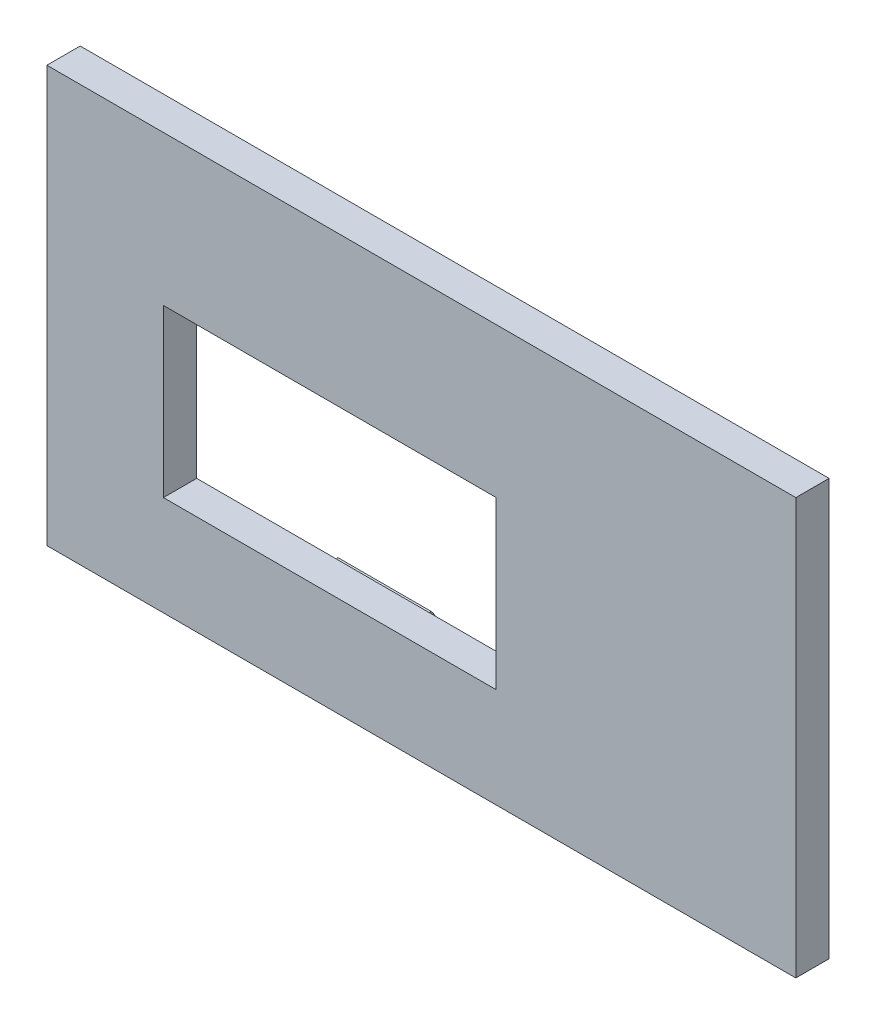
ISO-10303-21;
HEADER;
FILE_DESCRIPTION(('STEP AP214'),'2;1');
FILE_NAME('part.step','',(''),(''),'','','');
FILE_SCHEMA(('AUTOMOTIVE_DESIGN { 1 0 10303 214 1 1 1 1 }'));
ENDSEC;
DATA;
#1=APPLICATION_CONTEXT('core data for automotive mechanical design processes');
#2=APPLICATION_PROTOCOL_DEFINITION('international standard','automotive_design',2000,#1);
#3=PRODUCT_CONTEXT('',#1,'mechanical');
#4=PRODUCT('Part','Part','',(#3));
#5=PRODUCT_RELATED_PRODUCT_CATEGORY('part','',(#4));
#6=PRODUCT_DEFINITION_FORMATION('','',#4);
#7=PRODUCT_DEFINITION_CONTEXT('part definition',#1,'design');
#8=PRODUCT_DEFINITION('design','',#6,#7);
#9=PRODUCT_DEFINITION_SHAPE('','',#8);
#10=(LENGTH_UNIT() NAMED_UNIT(*) SI_UNIT(.MILLI.,.METRE.));
#11=(NAMED_UNIT(*) PLANE_ANGLE_UNIT() SI_UNIT($,.RADIAN.));
#12=(NAMED_UNIT(*) SI_UNIT($,.STERADIAN.) SOLID_ANGLE_UNIT());
#13=UNCERTAINTY_MEASURE_WITH_UNIT(LENGTH_MEASURE(1.E-05),#10,'distance_accuracy_value','');
#14=(GEOMETRIC_REPRESENTATION_CONTEXT(3) GLOBAL_UNCERTAINTY_ASSIGNED_CONTEXT((#13)) GLOBAL_UNIT_ASSIGNED_CONTEXT((#10,
#11,#12)) REPRESENTATION_CONTEXT('',''));
#15=CARTESIAN_POINT('',(0.,0.,0.));
#16=DIRECTION('',(0.,0.,1.));
#17=DIRECTION('',(1.,0.,0.));
#18=AXIS2_PLACEMENT_3D('',#15,#16,#17);
#19=CARTESIAN_POINT('',(20.6088165403814,-7.5,8.));
#20=DIRECTION('',(1.,0.,0.));
#21=DIRECTION('',(0.,0.,-1.));
#22=AXIS2_PLACEMENT_3D('',#19,#20,#21);
#23=CYLINDRICAL_SURFACE('',#22,1.);
#24=DIRECTION('',(1.,0.,0.));
#25=VECTOR('',#24,1.);
#26=CARTESIAN_POINT('',(-2.5,-8.5,8.));
#27=LINE('',#26,#25);
#28=CARTESIAN_POINT('',(-2.5,-8.5,8.));
#29=VERTEX_POINT('',#28);
#30=CARTESIAN_POINT('',(2.5,-8.5,8.));
#31=VERTEX_POINT('',#30);
#32=EDGE_CURVE('E782',#29,#31,#27,.T.);
#33=ORIENTED_EDGE('',*,*,#32,.F.);
#34=CARTESIAN_POINT('',(-2.5,-7.5,8.));
#35=DIRECTION('',(1.,0.,0.));
#36=DIRECTION('',(0.,0.,-1.));
#37=AXIS2_PLACEMENT_3D('',#34,#35,#36);
#38=CIRCLE('',#37,1.);
#39=CARTESIAN_POINT('',(-2.5,-6.79289321881346,7.29289321881345));
#40=VERTEX_POINT('',#39);
#41=EDGE_CURVE('E228',#29,#40,#38,.T.);
#42=ORIENTED_EDGE('',*,*,#41,.T.);
#43=DIRECTION('',(-1.,0.,0.));
#44=VECTOR('',#43,1.);
#45=CARTESIAN_POINT('',(23.5764722676078,-6.79289321881346,7.29289321881345));
#46=LINE('',#45,#44);
#47=CARTESIAN_POINT('',(-8.09013566471156,-6.79289321881346,7.29289321881345));
#48=VERTEX_POINT('',#47);
#49=EDGE_CURVE('E227',#40,#48,#46,.T.);
#50=ORIENTED_EDGE('',*,*,#49,.T.);
#51=CARTESIAN_POINT('',(-8.09013566471156,-7.5,8.));
#52=DIRECTION('',(1.,0.,0.));
#53=DIRECTION('',(0.,0.,-1.));
#54=AXIS2_PLACEMENT_3D('',#51,#52,#53);
#55=CIRCLE('',#54,1.);
#56=CARTESIAN_POINT('',(-8.09013566471156,-8.5,8.));
#57=VERTEX_POINT('',#56);
#58=EDGE_CURVE('E791',#57,#48,#55,.T.);
#59=ORIENTED_EDGE('',*,*,#58,.F.);
#60=CARTESIAN_POINT('',(-8.09013566471156,-7.5,8.));
#61=DIRECTION('',(-1.,0.,0.));
#62=DIRECTION('',(0.,0.,-1.));
#63=AXIS2_PLACEMENT_3D('',#60,#61,#62);
#64=CIRCLE('',#63,1.);
#65=CARTESIAN_POINT('',(-8.09013566471156,-6.5,8.));
#66=VERTEX_POINT('',#65);
#67=EDGE_CURVE('E58',#57,#66,#64,.T.);
#68=ORIENTED_EDGE('',*,*,#67,.T.);
#69=DIRECTION('',(1.,0.,0.));
#70=VECTOR('',#69,1.);
#71=CARTESIAN_POINT('',(20.6088165403814,-6.5,8.));
#72=LINE('',#71,#70);
#73=CARTESIAN_POINT('',(20.6088165403814,-6.5,8.));
#74=VERTEX_POINT('',#73);
#75=EDGE_CURVE('E391',#66,#74,#72,.T.);
#76=ORIENTED_EDGE('',*,*,#75,.T.);
#77=CARTESIAN_POINT('',(20.6088165403814,-7.5,8.));
#78=DIRECTION('',(-1.,0.,0.));
#79=DIRECTION('',(0.,0.,-1.));
#80=AXIS2_PLACEMENT_3D('',#77,#78,#79);
#81=CIRCLE('',#80,1.);
#82=CARTESIAN_POINT('',(20.6088165403814,-8.5,8.));
#83=VERTEX_POINT('',#82);
#84=EDGE_CURVE('E250',#83,#74,#81,.T.);
#85=ORIENTED_EDGE('',*,*,#84,.F.);
#86=CARTESIAN_POINT('',(20.6088165403814,-7.5,8.));
#87=DIRECTION('',(1.,0.,0.));
#88=DIRECTION('',(0.,0.,-1.));
#89=AXIS2_PLACEMENT_3D('',#86,#87,#88);
#90=CIRCLE('',#89,1.);
#91=CARTESIAN_POINT('',(20.6088165403814,-6.79289321881346,7.29289321881345));
#92=VERTEX_POINT('',#91);
#93=EDGE_CURVE('E244',#83,#92,#90,.T.);
#94=ORIENTED_EDGE('',*,*,#93,.T.);
#95=CARTESIAN_POINT('',(2.5,-6.79289321881346,7.29289321881345));
#96=VERTEX_POINT('',#95);
#97=EDGE_CURVE('E240',#92,#96,#46,.T.);
#98=ORIENTED_EDGE('',*,*,#97,.T.);
#99=CARTESIAN_POINT('',(2.5,-7.5,8.));
#100=DIRECTION('',(1.,0.,0.));
#101=DIRECTION('',(0.,0.,-1.));
#102=AXIS2_PLACEMENT_3D('',#99,#100,#101);
#103=CIRCLE('',#102,1.);
#104=EDGE_CURVE('E784',#31,#96,#103,.T.);
#105=ORIENTED_EDGE('',*,*,#104,.F.);
#106=EDGE_LOOP('',(#33,#42,#50,#59,#68,#76,#85,#94,#98,#105));
#107=FACE_BOUND('',#106,.T.);
#108=ADVANCED_FACE('F35',(#107),#23,.F.);
#109=CARTESIAN_POINT('',(23.5764722676078,-6.79289321881346,7.29289321881345));
#110=DIRECTION('',(0.,0.707106781186548,0.707106781186547));
#111=DIRECTION('',(0.,-0.707106781186547,0.707106781186548));
#112=AXIS2_PLACEMENT_3D('',#109,#110,#111);
#113=PLANE('',#112);
#114=ORIENTED_EDGE('',*,*,#49,.F.);
#115=DIRECTION('',(0.,0.707106781186548,-0.707106781186547));
#116=VECTOR('',#115,1.);
#117=CARTESIAN_POINT('',(-2.5,-6.79289321881346,7.29289321881345));
#118=LINE('',#117,#116);
#119=CARTESIAN_POINT('',(-2.5,-6.43933982822018,6.93933982822018));
#120=VERTEX_POINT('',#119);
#121=EDGE_CURVE('E213',#40,#120,#118,.T.);
#122=ORIENTED_EDGE('',*,*,#121,.T.);
#123=DIRECTION('',(-1.,0.,0.));
#124=VECTOR('',#123,1.);
#125=CARTESIAN_POINT('',(23.5764722676078,-6.43933982822018,6.93933982822018));
#126=LINE('',#125,#124);
#127=CARTESIAN_POINT('',(-8.09013566471156,-6.43933982822018,6.93933982822018));
#128=VERTEX_POINT('',#127);
#129=EDGE_CURVE('E225',#120,#128,#126,.T.);
#130=ORIENTED_EDGE('',*,*,#129,.T.);
#131=DIRECTION('',(0.,0.707106781186547,-0.707106781186548));
#132=VECTOR('',#131,1.);
#133=CARTESIAN_POINT('',(-8.09013566471156,-6.79289321881346,7.29289321881345));
#134=LINE('',#133,#132);
#135=EDGE_CURVE('E794',#48,#128,#134,.T.);
#136=ORIENTED_EDGE('',*,*,#135,.F.);
#137=EDGE_LOOP('',(#114,#122,#130,#136));
#138=FACE_BOUND('',#137,.T.);
#139=ADVANCED_FACE('F223',(#138),#113,.T.);
#140=CARTESIAN_POINT('',(23.5764722676078,-7.5,8.));
#141=DIRECTION('',(-1.,0.,0.));
#142=DIRECTION('',(0.,0.,1.));
#143=AXIS2_PLACEMENT_3D('',#140,#141,#142);
#144=CYLINDRICAL_SURFACE('',#143,1.5);
#145=ORIENTED_EDGE('',*,*,#129,.F.);
#146=CARTESIAN_POINT('',(-2.5,-7.5,8.));
#147=DIRECTION('',(-1.,0.,0.));
#148=DIRECTION('',(0.,0.,-1.));
#149=AXIS2_PLACEMENT_3D('',#146,#147,#148);
#150=CIRCLE('',#149,1.5);
#151=CARTESIAN_POINT('',(-2.5,-9.00000000000001,8.));
#152=VERTEX_POINT('',#151);
#153=EDGE_CURVE('E209',#120,#152,#150,.T.);
#154=ORIENTED_EDGE('',*,*,#153,.T.);
#155=DIRECTION('',(-1.,0.,0.));
#156=VECTOR('',#155,1.);
#157=CARTESIAN_POINT('',(23.5764722676078,-9.00000000000001,8.));
#158=LINE('',#157,#156);
#159=CARTESIAN_POINT('',(-8.09013566471156,-9.00000000000001,8.));
#160=VERTEX_POINT('',#159);
#161=EDGE_CURVE('E251',#152,#160,#158,.T.);
#162=ORIENTED_EDGE('',*,*,#161,.T.);
#163=CARTESIAN_POINT('',(-8.09013566471156,-7.5,8.));
#164=DIRECTION('',(-1.,0.,0.));
#165=DIRECTION('',(0.,0.,-1.));
#166=AXIS2_PLACEMENT_3D('',#163,#164,#165);
#167=CIRCLE('',#166,1.5);
#168=EDGE_CURVE('E232',#128,#160,#167,.T.);
#169=ORIENTED_EDGE('',*,*,#168,.F.);
#170=EDGE_LOOP('',(#145,#154,#162,#169));
#171=FACE_BOUND('',#170,.T.);
#172=ADVANCED_FACE('F230',(#171),#144,.T.);
#173=CARTESIAN_POINT('',(0.,0.,8.));
#174=DIRECTION('',(0.,0.,1.));
#175=DIRECTION('',(1.,0.,0.));
#176=AXIS2_PLACEMENT_3D('',#173,#174,#175);
#177=PLANE('',#176);
#178=CARTESIAN_POINT('',(20.6088165403814,-9.00000000000001,8.));
#179=VERTEX_POINT('',#178);
#180=CARTESIAN_POINT('',(2.5,-9.00000000000001,8.));
#181=VERTEX_POINT('',#180);
#182=EDGE_CURVE('E247',#179,#181,#158,.T.);
#183=ORIENTED_EDGE('',*,*,#182,.F.);
#184=DIRECTION('',(0.,1.,0.));
#185=VECTOR('',#184,1.);
#186=CARTESIAN_POINT('',(20.6088165403814,-9.00000000000001,8.));
#187=LINE('',#186,#185);
#188=EDGE_CURVE('E780',#179,#83,#187,.T.);
#189=ORIENTED_EDGE('',*,*,#188,.T.);
#190=DIRECTION('',(0.,1.,0.));
#191=VECTOR('',#190,1.);
#192=CARTESIAN_POINT('',(20.6088165403814,0.,8.));
#193=LINE('',#192,#191);
#194=EDGE_CURVE('E11',#83,#74,#193,.T.);
#195=ORIENTED_EDGE('',*,*,#194,.T.);
#196=ORIENTED_EDGE('',*,*,#75,.F.);
#197=DIRECTION('',(0.,-1.,0.));
#198=VECTOR('',#197,1.);
#199=CARTESIAN_POINT('',(-8.09013566471156,0.,8.));
#200=LINE('',#199,#198);
#201=EDGE_CURVE('E43',#66,#57,#200,.T.);
#202=ORIENTED_EDGE('',*,*,#201,.T.);
#203=DIRECTION('',(0.,1.,0.));
#204=VECTOR('',#203,1.);
#205=CARTESIAN_POINT('',(-8.09013566471156,-9.00000000000001,8.));
#206=LINE('',#205,#204);
#207=EDGE_CURVE('E399',#160,#57,#206,.T.);
#208=ORIENTED_EDGE('',*,*,#207,.F.);
#209=ORIENTED_EDGE('',*,*,#161,.F.);
#210=DIRECTION('',(0.,1.,0.));
#211=VECTOR('',#210,1.);
#212=CARTESIAN_POINT('',(-2.5,-9.00000000000001,8.));
#213=LINE('',#212,#211);
#214=EDGE_CURVE('E215',#152,#29,#213,.T.);
#215=ORIENTED_EDGE('',*,*,#214,.T.);
#216=ORIENTED_EDGE('',*,*,#32,.T.);
#217=DIRECTION('',(0.,1.,0.));
#218=VECTOR('',#217,1.);
#219=CARTESIAN_POINT('',(2.5,-9.00000000000001,8.));
#220=LINE('',#219,#218);
#221=EDGE_CURVE('E219',#181,#31,#220,.T.);
#222=ORIENTED_EDGE('',*,*,#221,.F.);
#223=EDGE_LOOP('',(#183,#189,#195,#196,#202,#208,#209,#215,#216,#222));
#224=FACE_BOUND('',#223,.T.);
#225=DIRECTION('',(0.,-1.,0.));
#226=VECTOR('',#225,1.);
#227=CARTESIAN_POINT('',(-8.09013566471156,9.00000000000001,8.));
#228=LINE('',#227,#226);
#229=CARTESIAN_POINT('',(-8.09013566471156,9.00000000000001,8.));
#230=VERTEX_POINT('',#229);
#231=CARTESIAN_POINT('',(-8.09013566471156,8.5,8.));
#232=VERTEX_POINT('',#231);
#233=EDGE_CURVE('E290',#230,#232,#228,.T.);
#234=ORIENTED_EDGE('',*,*,#233,.T.);
#235=DIRECTION('',(0.,-1.,0.));
#236=VECTOR('',#235,1.);
#237=CARTESIAN_POINT('',(-8.09013566471156,0.,8.));
#238=LINE('',#237,#236);
#239=CARTESIAN_POINT('',(-8.09013566471156,6.5,8.));
#240=VERTEX_POINT('',#239);
#241=EDGE_CURVE('E383',#232,#240,#238,.T.);
#242=ORIENTED_EDGE('',*,*,#241,.T.);
#243=DIRECTION('',(1.,0.,0.));
#244=VECTOR('',#243,1.);
#245=CARTESIAN_POINT('',(20.6088165403814,6.5,8.));
#246=LINE('',#245,#244);
#247=CARTESIAN_POINT('',(20.6088165403814,6.5,8.));
#248=VERTEX_POINT('',#247);
#249=EDGE_CURVE('E389',#248,#240,#246,.F.);
#250=ORIENTED_EDGE('',*,*,#249,.F.);
#251=DIRECTION('',(0.,1.,0.));
#252=VECTOR('',#251,1.);
#253=CARTESIAN_POINT('',(20.6088165403814,0.,8.));
#254=LINE('',#253,#252);
#255=CARTESIAN_POINT('',(20.6088165403814,8.5,8.));
#256=VERTEX_POINT('',#255);
#257=EDGE_CURVE('E386',#248,#256,#254,.T.);
#258=ORIENTED_EDGE('',*,*,#257,.T.);
#259=DIRECTION('',(0.,-1.,0.));
#260=VECTOR('',#259,1.);
#261=CARTESIAN_POINT('',(20.6088165403814,9.00000000000001,8.));
#262=LINE('',#261,#260);
#263=CARTESIAN_POINT('',(20.6088165403814,9.00000000000001,8.));
#264=VERTEX_POINT('',#263);
#265=EDGE_CURVE('E303',#264,#256,#262,.T.);
#266=ORIENTED_EDGE('',*,*,#265,.F.);
#267=DIRECTION('',(-1.,0.,0.));
#268=VECTOR('',#267,1.);
#269=CARTESIAN_POINT('',(23.5764722676078,9.00000000000001,8.));
#270=LINE('',#269,#268);
#271=CARTESIAN_POINT('',(2.5,9.00000000000001,8.));
#272=VERTEX_POINT('',#271);
#273=EDGE_CURVE('E293',#264,#272,#270,.T.);
#274=ORIENTED_EDGE('',*,*,#273,.T.);
#275=DIRECTION('',(0.,-1.,0.));
#276=VECTOR('',#275,1.);
#277=CARTESIAN_POINT('',(2.5,9.00000000000001,8.));
#278=LINE('',#277,#276);
#279=CARTESIAN_POINT('',(2.5,8.5,8.));
#280=VERTEX_POINT('',#279);
#281=EDGE_CURVE('E270',#272,#280,#278,.T.);
#282=ORIENTED_EDGE('',*,*,#281,.T.);
#283=DIRECTION('',(1.,0.,0.));
#284=VECTOR('',#283,1.);
#285=CARTESIAN_POINT('',(-2.5,8.5,8.));
#286=LINE('',#285,#284);
#287=CARTESIAN_POINT('',(-2.5,8.5,8.));
#288=VERTEX_POINT('',#287);
#289=EDGE_CURVE('E267',#288,#280,#286,.T.);
#290=ORIENTED_EDGE('',*,*,#289,.F.);
#291=DIRECTION('',(0.,-1.,0.));
#292=VECTOR('',#291,1.);
#293=CARTESIAN_POINT('',(-2.5,9.00000000000001,8.));
#294=LINE('',#293,#292);
#295=CARTESIAN_POINT('',(-2.5,9.00000000000001,8.));
#296=VERTEX_POINT('',#295);
#297=EDGE_CURVE('E259',#296,#288,#294,.T.);
#298=ORIENTED_EDGE('',*,*,#297,.F.);
#299=EDGE_CURVE('E297',#296,#230,#270,.T.);
#300=ORIENTED_EDGE('',*,*,#299,.T.);
#301=EDGE_LOOP('',(#234,#242,#250,#258,#266,#274,#282,#290,#298,#300));
#302=FACE_BOUND('',#301,.T.);
#303=DIRECTION('',(0.,-1.,0.));
#304=VECTOR('',#303,1.);
#305=CARTESIAN_POINT('',(22.5,0.,8.));
#306=LINE('',#305,#304);
#307=CARTESIAN_POINT('',(22.5,13.5,8.));
#308=VERTEX_POINT('',#307);
#309=CARTESIAN_POINT('',(22.5,-11.5,8.));
#310=VERTEX_POINT('',#309);
#311=EDGE_CURVE('E353',#308,#310,#306,.T.);
#312=ORIENTED_EDGE('',*,*,#311,.T.);
#313=DIRECTION('',(1.,0.,0.));
#314=VECTOR('',#313,1.);
#315=CARTESIAN_POINT('',(0.,-11.5,8.));
#316=LINE('',#315,#314);
#317=CARTESIAN_POINT('',(-22.5,-11.5,8.));
#318=VERTEX_POINT('',#317);
#319=EDGE_CURVE('E356',#318,#310,#316,.T.);
#320=ORIENTED_EDGE('',*,*,#319,.F.);
#321=DIRECTION('',(0.,1.,0.));
#322=VECTOR('',#321,1.);
#323=CARTESIAN_POINT('',(-22.5,0.,8.));
#324=LINE('',#323,#322);
#325=CARTESIAN_POINT('',(-22.5,13.5,8.));
#326=VERTEX_POINT('',#325);
#327=EDGE_CURVE('E355',#318,#326,#324,.T.);
#328=ORIENTED_EDGE('',*,*,#327,.T.);
#329=DIRECTION('',(-1.,0.,0.));
#330=VECTOR('',#329,1.);
#331=CARTESIAN_POINT('',(22.5,13.5,8.));
#332=LINE('',#331,#330);
#333=EDGE_CURVE('E350',#308,#326,#332,.T.);
#334=ORIENTED_EDGE('',*,*,#333,.F.);
#335=EDGE_LOOP('',(#312,#320,#328,#334));
#336=FACE_BOUND('',#335,.T.);
#337=DIRECTION('',(1.,0.,0.));
#338=VECTOR('',#337,1.);
#339=CARTESIAN_POINT('',(4.5,4.5,8.));
#340=LINE('',#339,#338);
#341=CARTESIAN_POINT('',(-15.5,4.5,8.));
#342=VERTEX_POINT('',#341);
#343=CARTESIAN_POINT('',(4.5,4.5,8.));
#344=VERTEX_POINT('',#343);
#345=EDGE_CURVE('E323',#342,#344,#340,.T.);
#346=ORIENTED_EDGE('',*,*,#345,.F.);
#347=DIRECTION('',(0.,1.,0.));
#348=VECTOR('',#347,1.);
#349=CARTESIAN_POINT('',(-15.5,4.5,8.));
#350=LINE('',#349,#348);
#351=CARTESIAN_POINT('',(-15.5,-5.5,8.));
#352=VERTEX_POINT('',#351);
#353=EDGE_CURVE('E321',#352,#342,#350,.T.);
#354=ORIENTED_EDGE('',*,*,#353,.F.);
#355=DIRECTION('',(-1.,0.,0.));
#356=VECTOR('',#355,1.);
#357=CARTESIAN_POINT('',(4.5,-5.5,8.));
#358=LINE('',#357,#356);
#359=CARTESIAN_POINT('',(4.5,-5.5,8.));
#360=VERTEX_POINT('',#359);
#361=EDGE_CURVE('E329',#360,#352,#358,.T.);
#362=ORIENTED_EDGE('',*,*,#361,.F.);
#363=DIRECTION('',(0.,-1.,0.));
#364=VECTOR('',#363,1.);
#365=CARTESIAN_POINT('',(4.5,4.5,8.));
#366=LINE('',#365,#364);
#367=EDGE_CURVE('E326',#344,#360,#366,.T.);
#368=ORIENTED_EDGE('',*,*,#367,.F.);
#369=EDGE_LOOP('',(#346,#354,#362,#368));
#370=FACE_BOUND('',#369,.T.);
#371=ADVANCED_FACE('F397',(#224,#302,#336,#370),#177,.F.);
#372=CARTESIAN_POINT('',(20.6088165403814,7.5,8.));
#373=DIRECTION('',(1.,0.,0.));
#374=DIRECTION('',(0.,0.,-1.));
#375=AXIS2_PLACEMENT_3D('',#372,#373,#374);
#376=CYLINDRICAL_SURFACE('',#375,1.);
#377=DIRECTION('',(-1.,0.,0.));
#378=VECTOR('',#377,1.);
#379=CARTESIAN_POINT('',(23.5764722676078,6.79289321881346,7.29289321881345));
#380=LINE('',#379,#378);
#381=CARTESIAN_POINT('',(-2.5,6.79289321881346,7.29289321881345));
#382=VERTEX_POINT('',#381);
#383=CARTESIAN_POINT('',(-8.09013566471156,6.79289321881346,7.29289321881345));
#384=VERTEX_POINT('',#383);
#385=EDGE_CURVE('E289',#382,#384,#380,.T.);
#386=ORIENTED_EDGE('',*,*,#385,.F.);
#387=CARTESIAN_POINT('',(-2.5,7.5,8.));
#388=DIRECTION('',(-1.,0.,0.));
#389=DIRECTION('',(0.,0.,-1.));
#390=AXIS2_PLACEMENT_3D('',#387,#388,#389);
#391=CIRCLE('',#390,1.);
#392=EDGE_CURVE('E263',#288,#382,#391,.T.);
#393=ORIENTED_EDGE('',*,*,#392,.F.);
#394=ORIENTED_EDGE('',*,*,#289,.T.);
#395=CARTESIAN_POINT('',(2.5,7.5,8.));
#396=DIRECTION('',(-1.,0.,0.));
#397=DIRECTION('',(0.,0.,-1.));
#398=AXIS2_PLACEMENT_3D('',#395,#396,#397);
#399=CIRCLE('',#398,1.);
#400=CARTESIAN_POINT('',(2.5,6.79289321881346,7.29289321881345));
#401=VERTEX_POINT('',#400);
#402=EDGE_CURVE('E273',#280,#401,#399,.T.);
#403=ORIENTED_EDGE('',*,*,#402,.T.);
#404=CARTESIAN_POINT('',(20.6088165403814,6.79289321881346,7.29289321881345));
#405=VERTEX_POINT('',#404);
#406=EDGE_CURVE('E285',#405,#401,#380,.T.);
#407=ORIENTED_EDGE('',*,*,#406,.F.);
#408=CARTESIAN_POINT('',(20.6088165403814,7.5,8.));
#409=DIRECTION('',(1.,0.,0.));
#410=DIRECTION('',(0.,0.,-1.));
#411=AXIS2_PLACEMENT_3D('',#408,#409,#410);
#412=CIRCLE('',#411,1.);
#413=EDGE_CURVE('E299',#256,#405,#412,.F.);
#414=ORIENTED_EDGE('',*,*,#413,.F.);
#415=CARTESIAN_POINT('',(20.6088165403814,7.5,8.));
#416=DIRECTION('',(1.,0.,0.));
#417=DIRECTION('',(0.,0.,-1.));
#418=AXIS2_PLACEMENT_3D('',#415,#416,#417);
#419=CIRCLE('',#418,1.);
#420=EDGE_CURVE('E302',#256,#248,#419,.T.);
#421=ORIENTED_EDGE('',*,*,#420,.T.);
#422=ORIENTED_EDGE('',*,*,#249,.T.);
#423=CARTESIAN_POINT('',(-8.09013566471156,7.5,8.));
#424=DIRECTION('',(1.,0.,0.));
#425=DIRECTION('',(0.,0.,-1.));
#426=AXIS2_PLACEMENT_3D('',#423,#424,#425);
#427=CIRCLE('',#426,1.);
#428=EDGE_CURVE('E318',#232,#240,#427,.T.);
#429=ORIENTED_EDGE('',*,*,#428,.F.);
#430=CARTESIAN_POINT('',(-8.09013566471156,7.5,8.));
#431=DIRECTION('',(-1.,0.,0.));
#432=DIRECTION('',(0.,0.,-1.));
#433=AXIS2_PLACEMENT_3D('',#430,#431,#432);
#434=CIRCLE('',#433,1.);
#435=EDGE_CURVE('E286',#232,#384,#434,.T.);
#436=ORIENTED_EDGE('',*,*,#435,.T.);
#437=EDGE_LOOP('',(#386,#393,#394,#403,#407,#414,#421,#422,#429,#436));
#438=FACE_BOUND('',#437,.T.);
#439=ADVANCED_FACE('F459',(#438),#376,.F.);
#440=CARTESIAN_POINT('',(23.5764722676078,7.5,8.));
#441=DIRECTION('',(-1.,0.,0.));
#442=DIRECTION('',(0.,0.,1.));
#443=AXIS2_PLACEMENT_3D('',#440,#441,#442);
#444=CYLINDRICAL_SURFACE('',#443,1.5);
#445=CARTESIAN_POINT('',(-2.5,7.5,8.));
#446=DIRECTION('',(1.,0.,0.));
#447=DIRECTION('',(0.,0.,-1.));
#448=AXIS2_PLACEMENT_3D('',#445,#446,#447);
#449=CIRCLE('',#448,1.5);
#450=CARTESIAN_POINT('',(-2.5,6.43933982822018,6.93933982822018));
#451=VERTEX_POINT('',#450);
#452=EDGE_CURVE('E256',#451,#296,#449,.T.);
#453=ORIENTED_EDGE('',*,*,#452,.F.);
#454=DIRECTION('',(-1.,0.,0.));
#455=VECTOR('',#454,1.);
#456=CARTESIAN_POINT('',(23.5764722676078,6.43933982822018,6.93933982822018));
#457=LINE('',#456,#455);
#458=CARTESIAN_POINT('',(-8.09013566471156,6.43933982822018,6.93933982822018));
#459=VERTEX_POINT('',#458);
#460=EDGE_CURVE('E280',#451,#459,#457,.T.);
#461=ORIENTED_EDGE('',*,*,#460,.T.);
#462=CARTESIAN_POINT('',(-8.09013566471156,7.5,8.));
#463=DIRECTION('',(1.,0.,0.));
#464=DIRECTION('',(0.,0.,-1.));
#465=AXIS2_PLACEMENT_3D('',#462,#463,#464);
#466=CIRCLE('',#465,1.5);
#467=EDGE_CURVE('E294',#459,#230,#466,.T.);
#468=ORIENTED_EDGE('',*,*,#467,.T.);
#469=ORIENTED_EDGE('',*,*,#299,.F.);
#470=EDGE_LOOP('',(#453,#461,#468,#469));
#471=FACE_BOUND('',#470,.T.);
#472=ADVANCED_FACE('F498',(#471),#444,.T.);
#473=CARTESIAN_POINT('',(23.5764722676078,6.79289321881346,7.29289321881345));
#474=DIRECTION('',(0.,0.707106781186548,-0.707106781186547));
#475=DIRECTION('',(0.,0.707106781186547,0.707106781186548));
#476=AXIS2_PLACEMENT_3D('',#473,#474,#475);
#477=PLANE('',#476);
#478=DIRECTION('',(0.,-0.707106781186548,-0.707106781186547));
#479=VECTOR('',#478,1.);
#480=CARTESIAN_POINT('',(-2.5,6.79289321881346,7.29289321881345));
#481=LINE('',#480,#479);
#482=EDGE_CURVE('E265',#382,#451,#481,.T.);
#483=ORIENTED_EDGE('',*,*,#482,.F.);
#484=ORIENTED_EDGE('',*,*,#385,.T.);
#485=DIRECTION('',(0.,-0.707106781186547,-0.707106781186548));
#486=VECTOR('',#485,1.);
#487=CARTESIAN_POINT('',(-8.09013566471156,6.79289321881346,7.29289321881345));
#488=LINE('',#487,#486);
#489=EDGE_CURVE('E281',#384,#459,#488,.T.);
#490=ORIENTED_EDGE('',*,*,#489,.T.);
#491=ORIENTED_EDGE('',*,*,#460,.F.);
#492=EDGE_LOOP('',(#483,#484,#490,#491));
#493=FACE_BOUND('',#492,.T.);
#494=ADVANCED_FACE('F507',(#493),#477,.F.);
#495=CARTESIAN_POINT('',(22.5,0.,10.));
#496=DIRECTION('',(1.,0.,0.));
#497=DIRECTION('',(0.,1.,0.));
#498=AXIS2_PLACEMENT_3D('',#495,#496,#497);
#499=PLANE('',#498);
#500=ORIENTED_EDGE('',*,*,#311,.F.);
#501=DIRECTION('',(0.,0.,-1.));
#502=VECTOR('',#501,1.);
#503=CARTESIAN_POINT('',(22.5,13.5,10.));
#504=LINE('',#503,#502);
#505=CARTESIAN_POINT('',(22.5,13.5,10.));
#506=VERTEX_POINT('',#505);
#507=EDGE_CURVE('E380',#506,#308,#504,.T.);
#508=ORIENTED_EDGE('',*,*,#507,.F.);
#509=DIRECTION('',(0.,-1.,0.));
#510=VECTOR('',#509,1.);
#511=CARTESIAN_POINT('',(22.5,0.,10.));
#512=LINE('',#511,#510);
#513=CARTESIAN_POINT('',(22.5,-11.5,10.));
#514=VERTEX_POINT('',#513);
#515=EDGE_CURVE('E359',#506,#514,#512,.T.);
#516=ORIENTED_EDGE('',*,*,#515,.T.);
#517=DIRECTION('',(0.,0.,-1.));
#518=VECTOR('',#517,1.);
#519=CARTESIAN_POINT('',(22.5,-11.5,10.));
#520=LINE('',#519,#518);
#521=EDGE_CURVE('E371',#514,#310,#520,.T.);
#522=ORIENTED_EDGE('',*,*,#521,.T.);
#523=EDGE_LOOP('',(#500,#508,#516,#522));
#524=FACE_BOUND('',#523,.T.);
#525=ADVANCED_FACE('F37',(#524),#499,.T.);
#526=CARTESIAN_POINT('',(-22.5,0.,10.));
#527=DIRECTION('',(-1.,0.,0.));
#528=DIRECTION('',(0.,0.,1.));
#529=AXIS2_PLACEMENT_3D('',#526,#527,#528);
#530=PLANE('',#529);
#531=DIRECTION('',(0.,0.,-1.));
#532=VECTOR('',#531,1.);
#533=CARTESIAN_POINT('',(-22.5,13.5,10.));
#534=LINE('',#533,#532);
#535=CARTESIAN_POINT('',(-22.5,13.5,10.));
#536=VERTEX_POINT('',#535);
#537=EDGE_CURVE('E377',#536,#326,#534,.T.);
#538=ORIENTED_EDGE('',*,*,#537,.T.);
#539=ORIENTED_EDGE('',*,*,#327,.F.);
#540=DIRECTION('',(0.,0.,-1.));
#541=VECTOR('',#540,1.);
#542=CARTESIAN_POINT('',(-22.5,-11.5,10.));
#543=LINE('',#542,#541);
#544=CARTESIAN_POINT('',(-22.5,-11.5,10.));
#545=VERTEX_POINT('',#544);
#546=EDGE_CURVE('E374',#545,#318,#543,.T.);
#547=ORIENTED_EDGE('',*,*,#546,.F.);
#548=DIRECTION('',(0.,1.,0.));
#549=VECTOR('',#548,1.);
#550=CARTESIAN_POINT('',(-22.5,0.,10.));
#551=LINE('',#550,#549);
#552=EDGE_CURVE('E366',#545,#536,#551,.T.);
#553=ORIENTED_EDGE('',*,*,#552,.T.);
#554=EDGE_LOOP('',(#538,#539,#547,#553));
#555=FACE_BOUND('',#554,.T.);
#556=ADVANCED_FACE('F525',(#555),#530,.T.);
#557=CARTESIAN_POINT('',(0.,13.5,10.));
#558=DIRECTION('',(0.,1.,0.));
#559=DIRECTION('',(0.,0.,1.));
#560=AXIS2_PLACEMENT_3D('',#557,#558,#559);
#561=PLANE('',#560);
#562=ORIENTED_EDGE('',*,*,#333,.T.);
#563=ORIENTED_EDGE('',*,*,#537,.F.);
#564=DIRECTION('',(1.,0.,0.));
#565=VECTOR('',#564,1.);
#566=CARTESIAN_POINT('',(0.,13.5,10.));
#567=LINE('',#566,#565);
#568=EDGE_CURVE('E363',#536,#506,#567,.T.);
#569=ORIENTED_EDGE('',*,*,#568,.T.);
#570=ORIENTED_EDGE('',*,*,#507,.T.);
#571=EDGE_LOOP('',(#562,#563,#569,#570));
#572=FACE_BOUND('',#571,.T.);
#573=ADVANCED_FACE('F533',(#572),#561,.T.);
#574=CARTESIAN_POINT('',(0.,-11.5,10.));
#575=DIRECTION('',(0.,1.,0.));
#576=DIRECTION('',(0.,0.,1.));
#577=AXIS2_PLACEMENT_3D('',#574,#575,#576);
#578=PLANE('',#577);
#579=ORIENTED_EDGE('',*,*,#546,.T.);
#580=ORIENTED_EDGE('',*,*,#319,.T.);
#581=ORIENTED_EDGE('',*,*,#521,.F.);
#582=DIRECTION('',(1.,0.,0.));
#583=VECTOR('',#582,1.);
#584=CARTESIAN_POINT('',(0.,-11.5,10.));
#585=LINE('',#584,#583);
#586=EDGE_CURVE('E369',#545,#514,#585,.T.);
#587=ORIENTED_EDGE('',*,*,#586,.F.);
#588=EDGE_LOOP('',(#579,#580,#581,#587));
#589=FACE_BOUND('',#588,.T.);
#590=ADVANCED_FACE('F541',(#589),#578,.F.);
#591=CARTESIAN_POINT('',(0.,0.,10.));
#592=DIRECTION('',(0.,0.,1.));
#593=DIRECTION('',(1.,0.,0.));
#594=AXIS2_PLACEMENT_3D('',#591,#592,#593);
#595=PLANE('',#594);
#596=DIRECTION('',(0.,-1.,0.));
#597=VECTOR('',#596,1.);
#598=CARTESIAN_POINT('',(-15.5,0.,10.));
#599=LINE('',#598,#597);
#600=CARTESIAN_POINT('',(-15.5,4.5,10.));
#601=VERTEX_POINT('',#600);
#602=CARTESIAN_POINT('',(-15.5,-5.5,10.));
#603=VERTEX_POINT('',#602);
#604=EDGE_CURVE('E348',#601,#603,#599,.T.);
#605=ORIENTED_EDGE('',*,*,#604,.F.);
#606=DIRECTION('',(-1.,0.,0.));
#607=VECTOR('',#606,1.);
#608=CARTESIAN_POINT('',(0.,4.5,10.));
#609=LINE('',#608,#607);
#610=CARTESIAN_POINT('',(4.5,4.5,10.));
#611=VERTEX_POINT('',#610);
#612=EDGE_CURVE('E335',#611,#601,#609,.T.);
#613=ORIENTED_EDGE('',*,*,#612,.F.);
#614=DIRECTION('',(0.,1.,0.));
#615=VECTOR('',#614,1.);
#616=CARTESIAN_POINT('',(4.5,0.,10.));
#617=LINE('',#616,#615);
#618=CARTESIAN_POINT('',(4.5,-5.5,10.));
#619=VERTEX_POINT('',#618);
#620=EDGE_CURVE('E343',#619,#611,#617,.T.);
#621=ORIENTED_EDGE('',*,*,#620,.F.);
#622=DIRECTION('',(1.,0.,0.));
#623=VECTOR('',#622,1.);
#624=CARTESIAN_POINT('',(0.,-5.5,10.));
#625=LINE('',#624,#623);
#626=EDGE_CURVE('E346',#603,#619,#625,.T.);
#627=ORIENTED_EDGE('',*,*,#626,.F.);
#628=EDGE_LOOP('',(#605,#613,#621,#627));
#629=FACE_BOUND('',#628,.T.);
#630=ORIENTED_EDGE('',*,*,#515,.F.);
#631=ORIENTED_EDGE('',*,*,#568,.F.);
#632=ORIENTED_EDGE('',*,*,#552,.F.);
#633=ORIENTED_EDGE('',*,*,#586,.T.);
#634=EDGE_LOOP('',(#630,#631,#632,#633));
#635=FACE_BOUND('',#634,.T.);
#636=ADVANCED_FACE('F548',(#629,#635),#595,.T.);
#637=CARTESIAN_POINT('',(-15.5,4.5,14.));
#638=DIRECTION('',(-1.,0.,0.));
#639=DIRECTION('',(0.,0.,1.));
#640=AXIS2_PLACEMENT_3D('',#637,#638,#639);
#641=PLANE('',#640);
#642=ORIENTED_EDGE('',*,*,#604,.T.);
#643=DIRECTION('',(0.,0.,-1.));
#644=VECTOR('',#643,1.);
#645=CARTESIAN_POINT('',(-15.5,-5.5,14.));
#646=LINE('',#645,#644);
#647=EDGE_CURVE('E333',#603,#352,#646,.T.);
#648=ORIENTED_EDGE('',*,*,#647,.T.);
#649=ORIENTED_EDGE('',*,*,#353,.T.);
#650=DIRECTION('',(0.,0.,-1.));
#651=VECTOR('',#650,1.);
#652=CARTESIAN_POINT('',(-15.5,4.5,14.));
#653=LINE('',#652,#651);
#654=EDGE_CURVE('E332',#601,#342,#653,.T.);
#655=ORIENTED_EDGE('',*,*,#654,.F.);
#656=EDGE_LOOP('',(#642,#648,#649,#655));
#657=FACE_BOUND('',#656,.T.);
#658=ADVANCED_FACE('F555',(#657),#641,.F.);
#659=CARTESIAN_POINT('',(4.5,-5.5,14.));
#660=DIRECTION('',(0.,-1.,0.));
#661=DIRECTION('',(1.,0.,0.));
#662=AXIS2_PLACEMENT_3D('',#659,#660,#661);
#663=PLANE('',#662);
#664=ORIENTED_EDGE('',*,*,#626,.T.);
#665=DIRECTION('',(0.,0.,-1.));
#666=VECTOR('',#665,1.);
#667=CARTESIAN_POINT('',(4.5,-5.5,14.));
#668=LINE('',#667,#666);
#669=EDGE_CURVE('E336',#619,#360,#668,.T.);
#670=ORIENTED_EDGE('',*,*,#669,.T.);
#671=ORIENTED_EDGE('',*,*,#361,.T.);
#672=ORIENTED_EDGE('',*,*,#647,.F.);
#673=EDGE_LOOP('',(#664,#670,#671,#672));
#674=FACE_BOUND('',#673,.T.);
#675=ADVANCED_FACE('F563',(#674),#663,.F.);
#676=CARTESIAN_POINT('',(4.5,4.5,14.));
#677=DIRECTION('',(1.,0.,0.));
#678=DIRECTION('',(0.,1.,0.));
#679=AXIS2_PLACEMENT_3D('',#676,#677,#678);
#680=PLANE('',#679);
#681=ORIENTED_EDGE('',*,*,#620,.T.);
#682=DIRECTION('',(0.,0.,-1.));
#683=VECTOR('',#682,1.);
#684=CARTESIAN_POINT('',(4.5,4.5,14.));
#685=LINE('',#684,#683);
#686=EDGE_CURVE('E338',#611,#344,#685,.T.);
#687=ORIENTED_EDGE('',*,*,#686,.T.);
#688=ORIENTED_EDGE('',*,*,#367,.T.);
#689=ORIENTED_EDGE('',*,*,#669,.F.);
#690=EDGE_LOOP('',(#681,#687,#688,#689));
#691=FACE_BOUND('',#690,.T.);
#692=ADVANCED_FACE('F571',(#691),#680,.F.);
#693=CARTESIAN_POINT('',(4.5,4.5,14.));
#694=DIRECTION('',(0.,1.,0.));
#695=DIRECTION('',(-1.,0.,0.));
#696=AXIS2_PLACEMENT_3D('',#693,#694,#695);
#697=PLANE('',#696);
#698=ORIENTED_EDGE('',*,*,#612,.T.);
#699=ORIENTED_EDGE('',*,*,#654,.T.);
#700=ORIENTED_EDGE('',*,*,#345,.T.);
#701=ORIENTED_EDGE('',*,*,#686,.F.);
#702=EDGE_LOOP('',(#698,#699,#700,#701));
#703=FACE_BOUND('',#702,.T.);
#704=ADVANCED_FACE('F579',(#703),#697,.F.);
#705=CARTESIAN_POINT('',(20.6088165403814,0.,8.));
#706=DIRECTION('',(1.,0.,0.));
#707=DIRECTION('',(0.,0.,-1.));
#708=AXIS2_PLACEMENT_3D('',#705,#706,#707);
#709=PLANE('',#708);
#710=ORIENTED_EDGE('',*,*,#420,.F.);
#711=ORIENTED_EDGE('',*,*,#257,.F.);
#712=EDGE_LOOP('',(#710,#711));
#713=FACE_BOUND('',#712,.T.);
#714=ADVANCED_FACE('F587',(#713),#709,.F.);
#715=CARTESIAN_POINT('',(-8.09013566471156,0.,8.));
#716=DIRECTION('',(-1.,0.,0.));
#717=DIRECTION('',(0.,0.,1.));
#718=AXIS2_PLACEMENT_3D('',#715,#716,#717);
#719=PLANE('',#718);
#720=ORIENTED_EDGE('',*,*,#428,.T.);
#721=ORIENTED_EDGE('',*,*,#241,.F.);
#722=EDGE_LOOP('',(#720,#721));
#723=FACE_BOUND('',#722,.T.);
#724=ADVANCED_FACE('F595',(#723),#719,.F.);
#725=CARTESIAN_POINT('',(20.6088165403814,6.43933982822018,6.93933982822018));
#726=VERTEX_POINT('',#725);
#727=CARTESIAN_POINT('',(2.5,6.43933982822018,6.93933982822018));
#728=VERTEX_POINT('',#727);
#729=EDGE_CURVE('E298',#726,#728,#457,.T.);
#730=ORIENTED_EDGE('',*,*,#729,.T.);
#731=CARTESIAN_POINT('',(2.5,7.5,8.));
#732=DIRECTION('',(1.,0.,0.));
#733=DIRECTION('',(0.,0.,-1.));
#734=AXIS2_PLACEMENT_3D('',#731,#732,#733);
#735=CIRCLE('',#734,1.5);
#736=EDGE_CURVE('E255',#728,#272,#735,.T.);
#737=ORIENTED_EDGE('',*,*,#736,.T.);
#738=ORIENTED_EDGE('',*,*,#273,.F.);
#739=CARTESIAN_POINT('',(20.6088165403814,7.5,8.));
#740=DIRECTION('',(1.,0.,0.));
#741=DIRECTION('',(0.,0.,-1.));
#742=AXIS2_PLACEMENT_3D('',#739,#740,#741);
#743=CIRCLE('',#742,1.5);
#744=EDGE_CURVE('E305',#726,#264,#743,.T.);
#745=ORIENTED_EDGE('',*,*,#744,.F.);
#746=EDGE_LOOP('',(#730,#737,#738,#745));
#747=FACE_BOUND('',#746,.T.);
#748=ADVANCED_FACE('F510',(#747),#444,.T.);
#749=ORIENTED_EDGE('',*,*,#406,.T.);
#750=DIRECTION('',(0.,-0.707106781186548,-0.707106781186547));
#751=VECTOR('',#750,1.);
#752=CARTESIAN_POINT('',(2.5,6.79289321881346,7.29289321881345));
#753=LINE('',#752,#751);
#754=EDGE_CURVE('E260',#401,#728,#753,.T.);
#755=ORIENTED_EDGE('',*,*,#754,.T.);
#756=ORIENTED_EDGE('',*,*,#729,.F.);
#757=DIRECTION('',(0.,-0.707106781186547,-0.707106781186548));
#758=VECTOR('',#757,1.);
#759=CARTESIAN_POINT('',(20.6088165403814,6.79289321881346,7.29289321881345));
#760=LINE('',#759,#758);
#761=EDGE_CURVE('E284',#405,#726,#760,.T.);
#762=ORIENTED_EDGE('',*,*,#761,.F.);
#763=EDGE_LOOP('',(#749,#755,#756,#762));
#764=FACE_BOUND('',#763,.T.);
#765=ADVANCED_FACE('F518',(#764),#477,.F.);
#766=CARTESIAN_POINT('',(-8.09013566471156,7.5,8.));
#767=DIRECTION('',(1.,0.,0.));
#768=DIRECTION('',(0.,0.,-1.));
#769=AXIS2_PLACEMENT_3D('',#766,#767,#768);
#770=PLANE('',#769);
#771=ORIENTED_EDGE('',*,*,#467,.F.);
#772=ORIENTED_EDGE('',*,*,#489,.F.);
#773=ORIENTED_EDGE('',*,*,#435,.F.);
#774=ORIENTED_EDGE('',*,*,#233,.F.);
#775=EDGE_LOOP('',(#771,#772,#773,#774));
#776=FACE_BOUND('',#775,.T.);
#777=ADVANCED_FACE('F616',(#776),#770,.F.);
#778=CARTESIAN_POINT('',(20.6088165403814,0.,8.));
#779=DIRECTION('',(1.,0.,0.));
#780=DIRECTION('',(0.,0.,-1.));
#781=AXIS2_PLACEMENT_3D('',#778,#779,#780);
#782=PLANE('',#781);
#783=ORIENTED_EDGE('',*,*,#761,.T.);
#784=ORIENTED_EDGE('',*,*,#744,.T.);
#785=ORIENTED_EDGE('',*,*,#265,.T.);
#786=ORIENTED_EDGE('',*,*,#413,.T.);
#787=EDGE_LOOP('',(#783,#784,#785,#786));
#788=FACE_BOUND('',#787,.T.);
#789=ADVANCED_FACE('F622',(#788),#782,.T.);
#790=CARTESIAN_POINT('',(-2.5,7.5,8.));
#791=DIRECTION('',(1.,0.,0.));
#792=DIRECTION('',(0.,0.,-1.));
#793=AXIS2_PLACEMENT_3D('',#790,#791,#792);
#794=PLANE('',#793);
#795=ORIENTED_EDGE('',*,*,#452,.T.);
#796=ORIENTED_EDGE('',*,*,#297,.T.);
#797=ORIENTED_EDGE('',*,*,#392,.T.);
#798=ORIENTED_EDGE('',*,*,#482,.T.);
#799=EDGE_LOOP('',(#795,#796,#797,#798));
#800=FACE_BOUND('',#799,.T.);
#801=ADVANCED_FACE('F629',(#800),#794,.T.);
#802=CARTESIAN_POINT('',(2.5,7.5,8.));
#803=DIRECTION('',(1.,0.,0.));
#804=DIRECTION('',(0.,0.,-1.));
#805=AXIS2_PLACEMENT_3D('',#802,#803,#804);
#806=PLANE('',#805);
#807=ORIENTED_EDGE('',*,*,#736,.F.);
#808=ORIENTED_EDGE('',*,*,#754,.F.);
#809=ORIENTED_EDGE('',*,*,#402,.F.);
#810=ORIENTED_EDGE('',*,*,#281,.F.);
#811=EDGE_LOOP('',(#807,#808,#809,#810));
#812=FACE_BOUND('',#811,.T.);
#813=ADVANCED_FACE('F413',(#812),#806,.F.);
#814=CARTESIAN_POINT('',(20.6088165403814,0.,8.));
#815=DIRECTION('',(1.,0.,0.));
#816=DIRECTION('',(0.,0.,-1.));
#817=AXIS2_PLACEMENT_3D('',#814,#815,#816);
#818=PLANE('',#817);
#819=ORIENTED_EDGE('',*,*,#84,.T.);
#820=ORIENTED_EDGE('',*,*,#194,.F.);
#821=EDGE_LOOP('',(#819,#820));
#822=FACE_BOUND('',#821,.T.);
#823=ADVANCED_FACE('F404',(#822),#818,.F.);
#824=CARTESIAN_POINT('',(-8.09013566471156,0.,8.));
#825=DIRECTION('',(-1.,0.,0.));
#826=DIRECTION('',(0.,0.,1.));
#827=AXIS2_PLACEMENT_3D('',#824,#825,#826);
#828=PLANE('',#827);
#829=ORIENTED_EDGE('',*,*,#67,.F.);
#830=ORIENTED_EDGE('',*,*,#201,.F.);
#831=EDGE_LOOP('',(#829,#830));
#832=FACE_BOUND('',#831,.T.);
#833=ADVANCED_FACE('F401',(#832),#828,.F.);
#834=CARTESIAN_POINT('',(20.6088165403814,0.,8.));
#835=DIRECTION('',(1.,0.,0.));
#836=DIRECTION('',(0.,0.,-1.));
#837=AXIS2_PLACEMENT_3D('',#834,#835,#836);
#838=PLANE('',#837);
#839=CARTESIAN_POINT('',(20.6088165403814,-7.5,8.));
#840=DIRECTION('',(1.,0.,0.));
#841=DIRECTION('',(0.,0.,-1.));
#842=AXIS2_PLACEMENT_3D('',#839,#840,#841);
#843=CIRCLE('',#842,1.5);
#844=CARTESIAN_POINT('',(20.6088165403814,-6.43933982822018,6.93933982822018));
#845=VERTEX_POINT('',#844);
#846=EDGE_CURVE('E238',#845,#179,#843,.F.);
#847=ORIENTED_EDGE('',*,*,#846,.F.);
#848=DIRECTION('',(0.,0.707106781186547,-0.707106781186548));
#849=VECTOR('',#848,1.);
#850=CARTESIAN_POINT('',(20.6088165403814,-6.79289321881346,7.29289321881345));
#851=LINE('',#850,#849);
#852=EDGE_CURVE('E235',#92,#845,#851,.T.);
#853=ORIENTED_EDGE('',*,*,#852,.F.);
#854=ORIENTED_EDGE('',*,*,#93,.F.);
#855=ORIENTED_EDGE('',*,*,#188,.F.);
#856=EDGE_LOOP('',(#847,#853,#854,#855));
#857=FACE_BOUND('',#856,.T.);
#858=ADVANCED_FACE('F403',(#857),#838,.T.);
#859=CARTESIAN_POINT('',(-8.09013566471156,-7.5,8.));
#860=DIRECTION('',(1.,0.,0.));
#861=DIRECTION('',(0.,0.,-1.));
#862=AXIS2_PLACEMENT_3D('',#859,#860,#861);
#863=PLANE('',#862);
#864=ORIENTED_EDGE('',*,*,#168,.T.);
#865=ORIENTED_EDGE('',*,*,#207,.T.);
#866=ORIENTED_EDGE('',*,*,#58,.T.);
#867=ORIENTED_EDGE('',*,*,#135,.T.);
#868=EDGE_LOOP('',(#864,#865,#866,#867));
#869=FACE_BOUND('',#868,.T.);
#870=ADVANCED_FACE('F410',(#869),#863,.F.);
#871=DIRECTION('',(0.,0.707106781186548,-0.707106781186547));
#872=VECTOR('',#871,1.);
#873=CARTESIAN_POINT('',(2.5,-6.79289321881346,7.29289321881345));
#874=LINE('',#873,#872);
#875=CARTESIAN_POINT('',(2.5,-6.43933982822018,6.93933982822018));
#876=VERTEX_POINT('',#875);
#877=EDGE_CURVE('E50',#96,#876,#874,.T.);
#878=ORIENTED_EDGE('',*,*,#877,.F.);
#879=ORIENTED_EDGE('',*,*,#97,.F.);
#880=ORIENTED_EDGE('',*,*,#852,.T.);
#881=EDGE_CURVE('E234',#845,#876,#126,.T.);
#882=ORIENTED_EDGE('',*,*,#881,.T.);
#883=EDGE_LOOP('',(#878,#879,#880,#882));
#884=FACE_BOUND('',#883,.T.);
#885=ADVANCED_FACE('F422',(#884),#113,.T.);
#886=CARTESIAN_POINT('',(2.5,-7.5,8.));
#887=DIRECTION('',(-1.,0.,0.));
#888=DIRECTION('',(0.,0.,-1.));
#889=AXIS2_PLACEMENT_3D('',#886,#887,#888);
#890=CIRCLE('',#889,1.5);
#891=EDGE_CURVE('E774',#876,#181,#890,.T.);
#892=ORIENTED_EDGE('',*,*,#891,.F.);
#893=ORIENTED_EDGE('',*,*,#881,.F.);
#894=ORIENTED_EDGE('',*,*,#846,.T.);
#895=ORIENTED_EDGE('',*,*,#182,.T.);
#896=EDGE_LOOP('',(#892,#893,#894,#895));
#897=FACE_BOUND('',#896,.T.);
#898=ADVANCED_FACE('F426',(#897),#144,.T.);
#899=CARTESIAN_POINT('',(-2.5,-7.5,8.));
#900=DIRECTION('',(1.,0.,0.));
#901=DIRECTION('',(0.,0.,-1.));
#902=AXIS2_PLACEMENT_3D('',#899,#900,#901);
#903=PLANE('',#902);
#904=ORIENTED_EDGE('',*,*,#153,.F.);
#905=ORIENTED_EDGE('',*,*,#121,.F.);
#906=ORIENTED_EDGE('',*,*,#41,.F.);
#907=ORIENTED_EDGE('',*,*,#214,.F.);
#908=EDGE_LOOP('',(#904,#905,#906,#907));
#909=FACE_BOUND('',#908,.T.);
#910=ADVANCED_FACE('F211',(#909),#903,.T.);
#911=CARTESIAN_POINT('',(2.5,-7.5,8.));
#912=DIRECTION('',(1.,0.,0.));
#913=DIRECTION('',(0.,0.,-1.));
#914=AXIS2_PLACEMENT_3D('',#911,#912,#913);
#915=PLANE('',#914);
#916=ORIENTED_EDGE('',*,*,#891,.T.);
#917=ORIENTED_EDGE('',*,*,#221,.T.);
#918=ORIENTED_EDGE('',*,*,#104,.T.);
#919=ORIENTED_EDGE('',*,*,#877,.T.);
#920=EDGE_LOOP('',(#916,#917,#918,#919));
#921=FACE_BOUND('',#920,.T.);
#922=ADVANCED_FACE('F434',(#921),#915,.F.);
#923=CLOSED_SHELL('',(#108,#139,#172,#371,#439,#472,#494,#525,#556,#573,#590,#636,#658,#675,
#692,#704,#714,#724,#748,#765,#777,#789,#801,#813,#823,#833,#858,#870,#885,#898,#910,#922));
#924=MANIFOLD_SOLID_BREP('B2',#923);
#925=ADVANCED_BREP_SHAPE_REPRESENTATION('',(#18,#924),#14);
#926=SHAPE_DEFINITION_REPRESENTATION(#9,#925);
ENDSEC;
END-ISO-10303-21;
